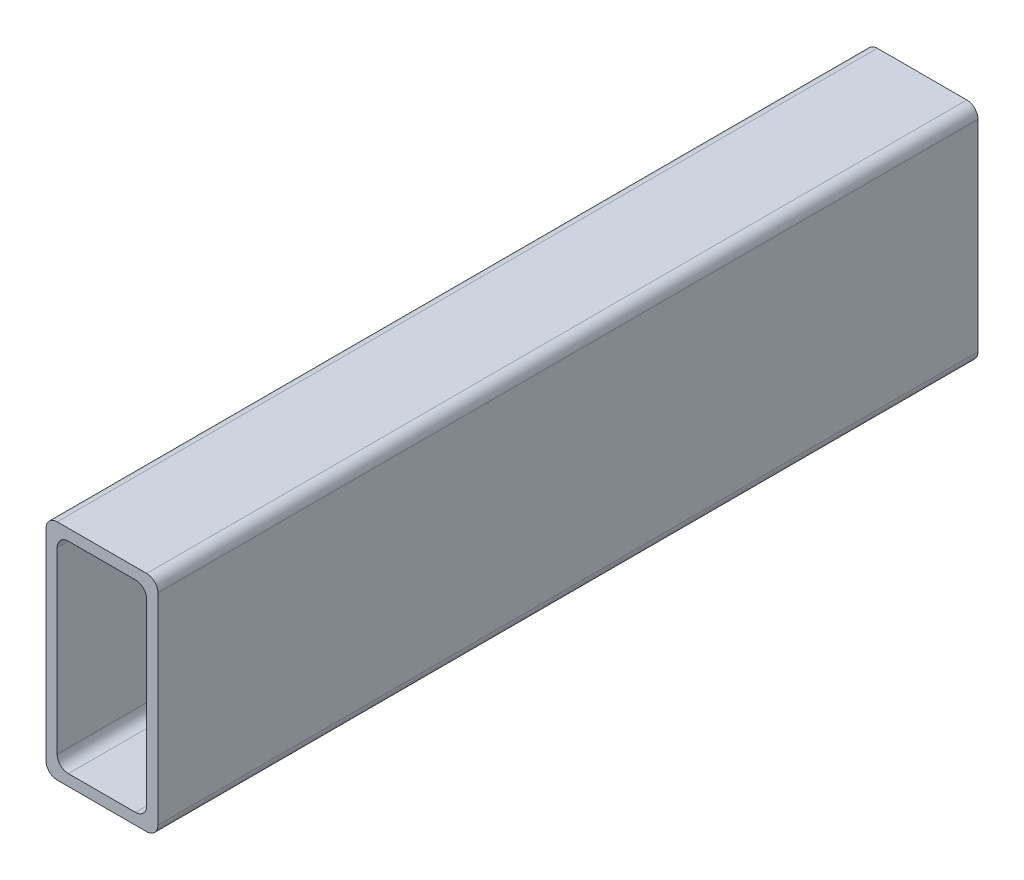
ISO-10303-21;
HEADER;
FILE_DESCRIPTION(('STEP AP214'),'2;1');
FILE_NAME('part.step','',(''),(''),'','','');
FILE_SCHEMA(('AUTOMOTIVE_DESIGN { 1 0 10303 214 1 1 1 1 }'));
ENDSEC;
DATA;
#1=APPLICATION_CONTEXT('core data for automotive mechanical design processes');
#2=APPLICATION_PROTOCOL_DEFINITION('international standard','automotive_design',2000,#1);
#3=PRODUCT_CONTEXT('',#1,'mechanical');
#4=PRODUCT('Part','Part','',(#3));
#5=PRODUCT_RELATED_PRODUCT_CATEGORY('part','',(#4));
#6=PRODUCT_DEFINITION_FORMATION('','',#4);
#7=PRODUCT_DEFINITION_CONTEXT('part definition',#1,'design');
#8=PRODUCT_DEFINITION('design','',#6,#7);
#9=PRODUCT_DEFINITION_SHAPE('','',#8);
#10=(LENGTH_UNIT() NAMED_UNIT(*) SI_UNIT(.MILLI.,.METRE.));
#11=(NAMED_UNIT(*) PLANE_ANGLE_UNIT() SI_UNIT($,.RADIAN.));
#12=(NAMED_UNIT(*) SI_UNIT($,.STERADIAN.) SOLID_ANGLE_UNIT());
#13=UNCERTAINTY_MEASURE_WITH_UNIT(LENGTH_MEASURE(1.E-05),#10,'distance_accuracy_value','');
#14=(GEOMETRIC_REPRESENTATION_CONTEXT(3) GLOBAL_UNCERTAINTY_ASSIGNED_CONTEXT((#13)) GLOBAL_UNIT_ASSIGNED_CONTEXT((#10,
#11,#12)) REPRESENTATION_CONTEXT('',''));
#15=CARTESIAN_POINT('',(0.,0.,0.));
#16=DIRECTION('',(0.,0.,1.));
#17=DIRECTION('',(1.,0.,0.));
#18=AXIS2_PLACEMENT_3D('',#15,#16,#17);
#19=CARTESIAN_POINT('',(-12.,27.,220.));
#20=DIRECTION('',(0.,0.,-1.));
#21=DIRECTION('',(-1.,0.,0.));
#22=AXIS2_PLACEMENT_3D('',#19,#20,#21);
#23=PLANE('',#22);
#24=CARTESIAN_POINT('',(-12.,27.,220.));
#25=DIRECTION('',(0.,0.,1.));
#26=DIRECTION('',(-1.,0.,0.));
#27=AXIS2_PLACEMENT_3D('',#24,#25,#26);
#28=CIRCLE('',#27,3.);
#29=CARTESIAN_POINT('',(-12.,30.,220.));
#30=VERTEX_POINT('',#29);
#31=CARTESIAN_POINT('',(-15.,27.,220.));
#32=VERTEX_POINT('',#31);
#33=EDGE_CURVE('E213',#30,#32,#28,.T.);
#34=ORIENTED_EDGE('',*,*,#33,.T.);
#35=DIRECTION('',(0.,-1.,0.));
#36=VECTOR('',#35,1.);
#37=CARTESIAN_POINT('',(-15.,-27.,220.));
#38=LINE('',#37,#36);
#39=CARTESIAN_POINT('',(-15.,-27.,220.));
#40=VERTEX_POINT('',#39);
#41=EDGE_CURVE('E216',#32,#40,#38,.T.);
#42=ORIENTED_EDGE('',*,*,#41,.T.);
#43=CARTESIAN_POINT('',(-12.,-27.,220.));
#44=DIRECTION('',(0.,0.,1.));
#45=DIRECTION('',(-1.,0.,0.));
#46=AXIS2_PLACEMENT_3D('',#43,#44,#45);
#47=CIRCLE('',#46,3.);
#48=CARTESIAN_POINT('',(-12.,-30.,220.));
#49=VERTEX_POINT('',#48);
#50=EDGE_CURVE('E219',#40,#49,#47,.T.);
#51=ORIENTED_EDGE('',*,*,#50,.T.);
#52=DIRECTION('',(1.,0.,0.));
#53=VECTOR('',#52,1.);
#54=CARTESIAN_POINT('',(-12.,-30.,220.));
#55=LINE('',#54,#53);
#56=CARTESIAN_POINT('',(12.,-30.,220.));
#57=VERTEX_POINT('',#56);
#58=EDGE_CURVE('E221',#49,#57,#55,.T.);
#59=ORIENTED_EDGE('',*,*,#58,.T.);
#60=CARTESIAN_POINT('',(12.,-27.,220.));
#61=DIRECTION('',(0.,0.,1.));
#62=DIRECTION('',(1.,0.,0.));
#63=AXIS2_PLACEMENT_3D('',#60,#61,#62);
#64=CIRCLE('',#63,3.);
#65=CARTESIAN_POINT('',(15.,-27.,220.));
#66=VERTEX_POINT('',#65);
#67=EDGE_CURVE('E223',#57,#66,#64,.T.);
#68=ORIENTED_EDGE('',*,*,#67,.T.);
#69=DIRECTION('',(0.,1.,0.));
#70=VECTOR('',#69,1.);
#71=CARTESIAN_POINT('',(15.,-27.,220.));
#72=LINE('',#71,#70);
#73=CARTESIAN_POINT('',(15.,27.,220.));
#74=VERTEX_POINT('',#73);
#75=EDGE_CURVE('E225',#66,#74,#72,.T.);
#76=ORIENTED_EDGE('',*,*,#75,.T.);
#77=CARTESIAN_POINT('',(12.,27.,220.));
#78=DIRECTION('',(0.,0.,1.));
#79=DIRECTION('',(-1.,0.,0.));
#80=AXIS2_PLACEMENT_3D('',#77,#78,#79);
#81=CIRCLE('',#80,3.);
#82=CARTESIAN_POINT('',(12.,30.,220.));
#83=VERTEX_POINT('',#82);
#84=EDGE_CURVE('E227',#74,#83,#81,.T.);
#85=ORIENTED_EDGE('',*,*,#84,.T.);
#86=DIRECTION('',(-1.,0.,0.));
#87=VECTOR('',#86,1.);
#88=CARTESIAN_POINT('',(-12.,30.,220.));
#89=LINE('',#88,#87);
#90=EDGE_CURVE('E229',#83,#30,#89,.T.);
#91=ORIENTED_EDGE('',*,*,#90,.T.);
#92=EDGE_LOOP('',(#34,#42,#51,#59,#68,#76,#85,#91));
#93=FACE_BOUND('',#92,.T.);
#94=CARTESIAN_POINT('',(-8.99999999999998,-24.,220.));
#95=DIRECTION('',(0.,0.,1.));
#96=DIRECTION('',(1.,0.,0.));
#97=AXIS2_PLACEMENT_3D('',#94,#95,#96);
#98=CIRCLE('',#97,3.);
#99=CARTESIAN_POINT('',(-12.,-24.,220.));
#100=VERTEX_POINT('',#99);
#101=CARTESIAN_POINT('',(-8.99999999999996,-27.,220.));
#102=VERTEX_POINT('',#101);
#103=EDGE_CURVE('E148',#100,#102,#98,.T.);
#104=ORIENTED_EDGE('',*,*,#103,.F.);
#105=DIRECTION('',(0.,-1.,0.));
#106=VECTOR('',#105,1.);
#107=CARTESIAN_POINT('',(-12.,-24.,220.));
#108=LINE('',#107,#106);
#109=CARTESIAN_POINT('',(-12.,24.,220.));
#110=VERTEX_POINT('',#109);
#111=EDGE_CURVE('E181',#110,#100,#108,.T.);
#112=ORIENTED_EDGE('',*,*,#111,.F.);
#113=CARTESIAN_POINT('',(-9.,24.,220.));
#114=DIRECTION('',(0.,0.,1.));
#115=DIRECTION('',(-1.,0.,0.));
#116=AXIS2_PLACEMENT_3D('',#113,#114,#115);
#117=CIRCLE('',#116,3.);
#118=CARTESIAN_POINT('',(-8.99999999999998,27.,220.));
#119=VERTEX_POINT('',#118);
#120=EDGE_CURVE('E179',#119,#110,#117,.T.);
#121=ORIENTED_EDGE('',*,*,#120,.F.);
#122=DIRECTION('',(-1.,0.,0.));
#123=VECTOR('',#122,1.);
#124=CARTESIAN_POINT('',(-8.99999999999998,27.,220.));
#125=LINE('',#124,#123);
#126=CARTESIAN_POINT('',(8.99999999999996,27.,220.));
#127=VERTEX_POINT('',#126);
#128=EDGE_CURVE('E177',#127,#119,#125,.T.);
#129=ORIENTED_EDGE('',*,*,#128,.F.);
#130=CARTESIAN_POINT('',(8.99999999999998,24.,220.));
#131=DIRECTION('',(0.,0.,1.));
#132=DIRECTION('',(-1.,0.,0.));
#133=AXIS2_PLACEMENT_3D('',#130,#131,#132);
#134=CIRCLE('',#133,3.);
#135=CARTESIAN_POINT('',(12.,24.,220.));
#136=VERTEX_POINT('',#135);
#137=EDGE_CURVE('E175',#136,#127,#134,.T.);
#138=ORIENTED_EDGE('',*,*,#137,.F.);
#139=DIRECTION('',(0.,1.,0.));
#140=VECTOR('',#139,1.);
#141=CARTESIAN_POINT('',(12.,-24.,220.));
#142=LINE('',#141,#140);
#143=CARTESIAN_POINT('',(12.,-24.,220.));
#144=VERTEX_POINT('',#143);
#145=EDGE_CURVE('E171',#144,#136,#142,.T.);
#146=ORIENTED_EDGE('',*,*,#145,.F.);
#147=CARTESIAN_POINT('',(9.,-24.,220.));
#148=DIRECTION('',(0.,0.,1.));
#149=DIRECTION('',(-1.,0.,0.));
#150=AXIS2_PLACEMENT_3D('',#147,#148,#149);
#151=CIRCLE('',#150,3.);
#152=CARTESIAN_POINT('',(8.99999999999998,-27.,220.));
#153=VERTEX_POINT('',#152);
#154=EDGE_CURVE('E169',#153,#144,#151,.T.);
#155=ORIENTED_EDGE('',*,*,#154,.F.);
#156=DIRECTION('',(1.,0.,0.));
#157=VECTOR('',#156,1.);
#158=CARTESIAN_POINT('',(-8.99999999999996,-27.,220.));
#159=LINE('',#158,#157);
#160=EDGE_CURVE('E156',#102,#153,#159,.T.);
#161=ORIENTED_EDGE('',*,*,#160,.F.);
#162=EDGE_LOOP('',(#104,#112,#121,#129,#138,#146,#155,#161));
#163=FACE_BOUND('',#162,.T.);
#164=ADVANCED_FACE('F35',(#93,#163),#23,.F.);
#165=CARTESIAN_POINT('',(-12.,27.,0.));
#166=DIRECTION('',(0.,0.,-1.));
#167=DIRECTION('',(-1.,0.,0.));
#168=AXIS2_PLACEMENT_3D('',#165,#166,#167);
#169=PLANE('',#168);
#170=CARTESIAN_POINT('',(-12.,27.,0.));
#171=DIRECTION('',(0.,0.,1.));
#172=DIRECTION('',(-1.,0.,0.));
#173=AXIS2_PLACEMENT_3D('',#170,#171,#172);
#174=CIRCLE('',#173,3.);
#175=CARTESIAN_POINT('',(-12.,30.,0.));
#176=VERTEX_POINT('',#175);
#177=CARTESIAN_POINT('',(-15.,27.,0.));
#178=VERTEX_POINT('',#177);
#179=EDGE_CURVE('E164',#176,#178,#174,.T.);
#180=ORIENTED_EDGE('',*,*,#179,.F.);
#181=DIRECTION('',(-1.,0.,0.));
#182=VECTOR('',#181,1.);
#183=CARTESIAN_POINT('',(-12.,30.,0.));
#184=LINE('',#183,#182);
#185=CARTESIAN_POINT('',(12.,30.,0.));
#186=VERTEX_POINT('',#185);
#187=EDGE_CURVE('E217',#186,#176,#184,.T.);
#188=ORIENTED_EDGE('',*,*,#187,.F.);
#189=CARTESIAN_POINT('',(12.,27.,0.));
#190=DIRECTION('',(0.,0.,1.));
#191=DIRECTION('',(-1.,0.,0.));
#192=AXIS2_PLACEMENT_3D('',#189,#190,#191);
#193=CIRCLE('',#192,3.);
#194=CARTESIAN_POINT('',(15.,27.,0.));
#195=VERTEX_POINT('',#194);
#196=EDGE_CURVE('E244',#195,#186,#193,.T.);
#197=ORIENTED_EDGE('',*,*,#196,.F.);
#198=DIRECTION('',(0.,1.,0.));
#199=VECTOR('',#198,1.);
#200=CARTESIAN_POINT('',(15.,-27.,0.));
#201=LINE('',#200,#199);
#202=CARTESIAN_POINT('',(15.,-27.,0.));
#203=VERTEX_POINT('',#202);
#204=EDGE_CURVE('E242',#203,#195,#201,.T.);
#205=ORIENTED_EDGE('',*,*,#204,.F.);
#206=CARTESIAN_POINT('',(12.,-27.,0.));
#207=DIRECTION('',(0.,0.,1.));
#208=DIRECTION('',(1.,0.,0.));
#209=AXIS2_PLACEMENT_3D('',#206,#207,#208);
#210=CIRCLE('',#209,3.);
#211=CARTESIAN_POINT('',(12.,-30.,0.));
#212=VERTEX_POINT('',#211);
#213=EDGE_CURVE('E240',#212,#203,#210,.T.);
#214=ORIENTED_EDGE('',*,*,#213,.F.);
#215=DIRECTION('',(1.,0.,0.));
#216=VECTOR('',#215,1.);
#217=CARTESIAN_POINT('',(-12.,-30.,0.));
#218=LINE('',#217,#216);
#219=CARTESIAN_POINT('',(-12.,-30.,0.));
#220=VERTEX_POINT('',#219);
#221=EDGE_CURVE('E238',#220,#212,#218,.T.);
#222=ORIENTED_EDGE('',*,*,#221,.F.);
#223=CARTESIAN_POINT('',(-12.,-27.,0.));
#224=DIRECTION('',(0.,0.,1.));
#225=DIRECTION('',(-1.,0.,0.));
#226=AXIS2_PLACEMENT_3D('',#223,#224,#225);
#227=CIRCLE('',#226,3.);
#228=CARTESIAN_POINT('',(-15.,-27.,0.));
#229=VERTEX_POINT('',#228);
#230=EDGE_CURVE('E236',#229,#220,#227,.T.);
#231=ORIENTED_EDGE('',*,*,#230,.F.);
#232=DIRECTION('',(0.,-1.,0.));
#233=VECTOR('',#232,1.);
#234=CARTESIAN_POINT('',(-15.,-27.,0.));
#235=LINE('',#234,#233);
#236=EDGE_CURVE('E234',#178,#229,#235,.T.);
#237=ORIENTED_EDGE('',*,*,#236,.F.);
#238=EDGE_LOOP('',(#180,#188,#197,#205,#214,#222,#231,#237));
#239=FACE_BOUND('',#238,.T.);
#240=DIRECTION('',(0.,-1.,0.));
#241=VECTOR('',#240,1.);
#242=CARTESIAN_POINT('',(-12.,-24.,0.));
#243=LINE('',#242,#241);
#244=CARTESIAN_POINT('',(-12.,24.,0.));
#245=VERTEX_POINT('',#244);
#246=CARTESIAN_POINT('',(-12.,-24.,0.));
#247=VERTEX_POINT('',#246);
#248=EDGE_CURVE('E157',#245,#247,#243,.T.);
#249=ORIENTED_EDGE('',*,*,#248,.T.);
#250=CARTESIAN_POINT('',(-8.99999999999998,-24.,0.));
#251=DIRECTION('',(0.,0.,1.));
#252=DIRECTION('',(1.,0.,0.));
#253=AXIS2_PLACEMENT_3D('',#250,#251,#252);
#254=CIRCLE('',#253,3.);
#255=CARTESIAN_POINT('',(-8.99999999999996,-27.,0.));
#256=VERTEX_POINT('',#255);
#257=EDGE_CURVE('E58',#247,#256,#254,.T.);
#258=ORIENTED_EDGE('',*,*,#257,.T.);
#259=DIRECTION('',(1.,0.,0.));
#260=VECTOR('',#259,1.);
#261=CARTESIAN_POINT('',(-8.99999999999996,-27.,0.));
#262=LINE('',#261,#260);
#263=CARTESIAN_POINT('',(8.99999999999998,-27.,0.));
#264=VERTEX_POINT('',#263);
#265=EDGE_CURVE('E163',#256,#264,#262,.T.);
#266=ORIENTED_EDGE('',*,*,#265,.T.);
#267=CARTESIAN_POINT('',(9.,-24.,0.));
#268=DIRECTION('',(0.,0.,1.));
#269=DIRECTION('',(-1.,0.,0.));
#270=AXIS2_PLACEMENT_3D('',#267,#268,#269);
#271=CIRCLE('',#270,3.);
#272=CARTESIAN_POINT('',(12.,-24.,0.));
#273=VERTEX_POINT('',#272);
#274=EDGE_CURVE('E185',#264,#273,#271,.T.);
#275=ORIENTED_EDGE('',*,*,#274,.T.);
#276=DIRECTION('',(0.,1.,0.));
#277=VECTOR('',#276,1.);
#278=CARTESIAN_POINT('',(12.,-24.,0.));
#279=LINE('',#278,#277);
#280=CARTESIAN_POINT('',(12.,24.,0.));
#281=VERTEX_POINT('',#280);
#282=EDGE_CURVE('E188',#273,#281,#279,.T.);
#283=ORIENTED_EDGE('',*,*,#282,.T.);
#284=CARTESIAN_POINT('',(8.99999999999998,24.,0.));
#285=DIRECTION('',(0.,0.,1.));
#286=DIRECTION('',(-1.,0.,0.));
#287=AXIS2_PLACEMENT_3D('',#284,#285,#286);
#288=CIRCLE('',#287,3.);
#289=CARTESIAN_POINT('',(8.99999999999996,27.,0.));
#290=VERTEX_POINT('',#289);
#291=EDGE_CURVE('E191',#281,#290,#288,.T.);
#292=ORIENTED_EDGE('',*,*,#291,.T.);
#293=DIRECTION('',(-1.,0.,0.));
#294=VECTOR('',#293,1.);
#295=CARTESIAN_POINT('',(-8.99999999999998,27.,0.));
#296=LINE('',#295,#294);
#297=CARTESIAN_POINT('',(-8.99999999999998,27.,0.));
#298=VERTEX_POINT('',#297);
#299=EDGE_CURVE('E194',#290,#298,#296,.T.);
#300=ORIENTED_EDGE('',*,*,#299,.T.);
#301=CARTESIAN_POINT('',(-9.,24.,0.));
#302=DIRECTION('',(0.,0.,1.));
#303=DIRECTION('',(-1.,0.,0.));
#304=AXIS2_PLACEMENT_3D('',#301,#302,#303);
#305=CIRCLE('',#304,3.);
#306=EDGE_CURVE('E197',#298,#245,#305,.T.);
#307=ORIENTED_EDGE('',*,*,#306,.T.);
#308=EDGE_LOOP('',(#249,#258,#266,#275,#283,#292,#300,#307));
#309=FACE_BOUND('',#308,.T.);
#310=ADVANCED_FACE('F274',(#239,#309),#169,.T.);
#311=CARTESIAN_POINT('',(-12.,27.,220.));
#312=DIRECTION('',(0.,0.,-1.));
#313=DIRECTION('',(-1.,0.,0.));
#314=AXIS2_PLACEMENT_3D('',#311,#312,#313);
#315=CYLINDRICAL_SURFACE('',#314,3.);
#316=ORIENTED_EDGE('',*,*,#179,.T.);
#317=DIRECTION('',(0.,0.,-1.));
#318=VECTOR('',#317,1.);
#319=CARTESIAN_POINT('',(-15.,27.,220.));
#320=LINE('',#319,#318);
#321=EDGE_CURVE('E11',#32,#178,#320,.T.);
#322=ORIENTED_EDGE('',*,*,#321,.F.);
#323=ORIENTED_EDGE('',*,*,#33,.F.);
#324=DIRECTION('',(0.,0.,-1.));
#325=VECTOR('',#324,1.);
#326=CARTESIAN_POINT('',(-12.,30.,220.));
#327=LINE('',#326,#325);
#328=EDGE_CURVE('E231',#30,#176,#327,.T.);
#329=ORIENTED_EDGE('',*,*,#328,.T.);
#330=EDGE_LOOP('',(#316,#322,#323,#329));
#331=FACE_BOUND('',#330,.T.);
#332=ADVANCED_FACE('F37',(#331),#315,.T.);
#333=CARTESIAN_POINT('',(-15.,-27.,220.));
#334=DIRECTION('',(1.,0.,0.));
#335=DIRECTION('',(0.,0.,-1.));
#336=AXIS2_PLACEMENT_3D('',#333,#334,#335);
#337=PLANE('',#336);
#338=ORIENTED_EDGE('',*,*,#236,.T.);
#339=DIRECTION('',(0.,0.,-1.));
#340=VECTOR('',#339,1.);
#341=CARTESIAN_POINT('',(-15.,-27.,220.));
#342=LINE('',#341,#340);
#343=EDGE_CURVE('E43',#40,#229,#342,.T.);
#344=ORIENTED_EDGE('',*,*,#343,.F.);
#345=ORIENTED_EDGE('',*,*,#41,.F.);
#346=ORIENTED_EDGE('',*,*,#321,.T.);
#347=EDGE_LOOP('',(#338,#344,#345,#346));
#348=FACE_BOUND('',#347,.T.);
#349=ADVANCED_FACE('F291',(#348),#337,.F.);
#350=CARTESIAN_POINT('',(-12.,-27.,220.));
#351=DIRECTION('',(0.,0.,-1.));
#352=DIRECTION('',(-1.,0.,0.));
#353=AXIS2_PLACEMENT_3D('',#350,#351,#352);
#354=CYLINDRICAL_SURFACE('',#353,3.);
#355=ORIENTED_EDGE('',*,*,#230,.T.);
#356=DIRECTION('',(0.,0.,-1.));
#357=VECTOR('',#356,1.);
#358=CARTESIAN_POINT('',(-12.,-30.,220.));
#359=LINE('',#358,#357);
#360=EDGE_CURVE('E261',#49,#220,#359,.T.);
#361=ORIENTED_EDGE('',*,*,#360,.F.);
#362=ORIENTED_EDGE('',*,*,#50,.F.);
#363=ORIENTED_EDGE('',*,*,#343,.T.);
#364=EDGE_LOOP('',(#355,#361,#362,#363));
#365=FACE_BOUND('',#364,.T.);
#366=ADVANCED_FACE('F268',(#365),#354,.T.);
#367=CARTESIAN_POINT('',(-12.,-30.,220.));
#368=DIRECTION('',(0.,1.,0.));
#369=DIRECTION('',(0.,0.,1.));
#370=AXIS2_PLACEMENT_3D('',#367,#368,#369);
#371=PLANE('',#370);
#372=ORIENTED_EDGE('',*,*,#221,.T.);
#373=DIRECTION('',(0.,0.,-1.));
#374=VECTOR('',#373,1.);
#375=CARTESIAN_POINT('',(12.,-30.,220.));
#376=LINE('',#375,#374);
#377=EDGE_CURVE('E258',#57,#212,#376,.T.);
#378=ORIENTED_EDGE('',*,*,#377,.F.);
#379=ORIENTED_EDGE('',*,*,#58,.F.);
#380=ORIENTED_EDGE('',*,*,#360,.T.);
#381=EDGE_LOOP('',(#372,#378,#379,#380));
#382=FACE_BOUND('',#381,.T.);
#383=ADVANCED_FACE('F280',(#382),#371,.F.);
#384=CARTESIAN_POINT('',(12.,-27.,220.));
#385=DIRECTION('',(0.,0.,-1.));
#386=DIRECTION('',(-1.,0.,0.));
#387=AXIS2_PLACEMENT_3D('',#384,#385,#386);
#388=CYLINDRICAL_SURFACE('',#387,3.);
#389=ORIENTED_EDGE('',*,*,#213,.T.);
#390=DIRECTION('',(0.,0.,-1.));
#391=VECTOR('',#390,1.);
#392=CARTESIAN_POINT('',(15.,-27.,220.));
#393=LINE('',#392,#391);
#394=EDGE_CURVE('E255',#66,#203,#393,.T.);
#395=ORIENTED_EDGE('',*,*,#394,.F.);
#396=ORIENTED_EDGE('',*,*,#67,.F.);
#397=ORIENTED_EDGE('',*,*,#377,.T.);
#398=EDGE_LOOP('',(#389,#395,#396,#397));
#399=FACE_BOUND('',#398,.T.);
#400=ADVANCED_FACE('F284',(#399),#388,.T.);
#401=CARTESIAN_POINT('',(15.,-27.,220.));
#402=DIRECTION('',(-1.,0.,0.));
#403=DIRECTION('',(0.,0.,1.));
#404=AXIS2_PLACEMENT_3D('',#401,#402,#403);
#405=PLANE('',#404);
#406=ORIENTED_EDGE('',*,*,#204,.T.);
#407=DIRECTION('',(0.,0.,-1.));
#408=VECTOR('',#407,1.);
#409=CARTESIAN_POINT('',(15.,27.,220.));
#410=LINE('',#409,#408);
#411=EDGE_CURVE('E252',#74,#195,#410,.T.);
#412=ORIENTED_EDGE('',*,*,#411,.F.);
#413=ORIENTED_EDGE('',*,*,#75,.F.);
#414=ORIENTED_EDGE('',*,*,#394,.T.);
#415=EDGE_LOOP('',(#406,#412,#413,#414));
#416=FACE_BOUND('',#415,.T.);
#417=ADVANCED_FACE('F304',(#416),#405,.F.);
#418=CARTESIAN_POINT('',(12.,27.,220.));
#419=DIRECTION('',(0.,0.,-1.));
#420=DIRECTION('',(-1.,0.,0.));
#421=AXIS2_PLACEMENT_3D('',#418,#419,#420);
#422=CYLINDRICAL_SURFACE('',#421,3.);
#423=ORIENTED_EDGE('',*,*,#196,.T.);
#424=DIRECTION('',(0.,0.,-1.));
#425=VECTOR('',#424,1.);
#426=CARTESIAN_POINT('',(12.,30.,220.));
#427=LINE('',#426,#425);
#428=EDGE_CURVE('E249',#83,#186,#427,.T.);
#429=ORIENTED_EDGE('',*,*,#428,.F.);
#430=ORIENTED_EDGE('',*,*,#84,.F.);
#431=ORIENTED_EDGE('',*,*,#411,.T.);
#432=EDGE_LOOP('',(#423,#429,#430,#431));
#433=FACE_BOUND('',#432,.T.);
#434=ADVANCED_FACE('F302',(#433),#422,.T.);
#435=CARTESIAN_POINT('',(-12.,30.,220.));
#436=DIRECTION('',(0.,-1.,0.));
#437=DIRECTION('',(0.,0.,-1.));
#438=AXIS2_PLACEMENT_3D('',#435,#436,#437);
#439=PLANE('',#438);
#440=ORIENTED_EDGE('',*,*,#187,.T.);
#441=ORIENTED_EDGE('',*,*,#328,.F.);
#442=ORIENTED_EDGE('',*,*,#90,.F.);
#443=ORIENTED_EDGE('',*,*,#428,.T.);
#444=EDGE_LOOP('',(#440,#441,#442,#443));
#445=FACE_BOUND('',#444,.T.);
#446=ADVANCED_FACE('F297',(#445),#439,.F.);
#447=CARTESIAN_POINT('',(-8.99999999999998,-24.,220.));
#448=DIRECTION('',(0.,0.,-1.));
#449=DIRECTION('',(-1.,0.,0.));
#450=AXIS2_PLACEMENT_3D('',#447,#448,#449);
#451=CYLINDRICAL_SURFACE('',#450,3.);
#452=ORIENTED_EDGE('',*,*,#257,.F.);
#453=DIRECTION('',(0.,0.,-1.));
#454=VECTOR('',#453,1.);
#455=CARTESIAN_POINT('',(-12.,-24.,220.));
#456=LINE('',#455,#454);
#457=EDGE_CURVE('E152',#100,#247,#456,.T.);
#458=ORIENTED_EDGE('',*,*,#457,.F.);
#459=ORIENTED_EDGE('',*,*,#103,.T.);
#460=DIRECTION('',(0.,0.,-1.));
#461=VECTOR('',#460,1.);
#462=CARTESIAN_POINT('',(-8.99999999999996,-27.,220.));
#463=LINE('',#462,#461);
#464=EDGE_CURVE('E151',#102,#256,#463,.T.);
#465=ORIENTED_EDGE('',*,*,#464,.T.);
#466=EDGE_LOOP('',(#452,#458,#459,#465));
#467=FACE_BOUND('',#466,.T.);
#468=ADVANCED_FACE('F150',(#467),#451,.F.);
#469=CARTESIAN_POINT('',(-8.99999999999996,-27.,220.));
#470=DIRECTION('',(0.,1.,0.));
#471=DIRECTION('',(-1.,0.,0.));
#472=AXIS2_PLACEMENT_3D('',#469,#470,#471);
#473=PLANE('',#472);
#474=ORIENTED_EDGE('',*,*,#265,.F.);
#475=ORIENTED_EDGE('',*,*,#464,.F.);
#476=ORIENTED_EDGE('',*,*,#160,.T.);
#477=DIRECTION('',(0.,0.,-1.));
#478=VECTOR('',#477,1.);
#479=CARTESIAN_POINT('',(8.99999999999998,-27.,220.));
#480=LINE('',#479,#478);
#481=EDGE_CURVE('E165',#153,#264,#480,.T.);
#482=ORIENTED_EDGE('',*,*,#481,.T.);
#483=EDGE_LOOP('',(#474,#475,#476,#482));
#484=FACE_BOUND('',#483,.T.);
#485=ADVANCED_FACE('F160',(#484),#473,.T.);
#486=CARTESIAN_POINT('',(9.,-24.,220.));
#487=DIRECTION('',(0.,0.,-1.));
#488=DIRECTION('',(-1.,0.,0.));
#489=AXIS2_PLACEMENT_3D('',#486,#487,#488);
#490=CYLINDRICAL_SURFACE('',#489,3.);
#491=ORIENTED_EDGE('',*,*,#274,.F.);
#492=ORIENTED_EDGE('',*,*,#481,.F.);
#493=ORIENTED_EDGE('',*,*,#154,.T.);
#494=DIRECTION('',(0.,0.,-1.));
#495=VECTOR('',#494,1.);
#496=CARTESIAN_POINT('',(12.,-24.,220.));
#497=LINE('',#496,#495);
#498=EDGE_CURVE('E210',#144,#273,#497,.T.);
#499=ORIENTED_EDGE('',*,*,#498,.T.);
#500=EDGE_LOOP('',(#491,#492,#493,#499));
#501=FACE_BOUND('',#500,.T.);
#502=ADVANCED_FACE('F329',(#501),#490,.F.);
#503=CARTESIAN_POINT('',(12.,-24.,220.));
#504=DIRECTION('',(-1.,0.,0.));
#505=DIRECTION('',(0.,-1.,0.));
#506=AXIS2_PLACEMENT_3D('',#503,#504,#505);
#507=PLANE('',#506);
#508=ORIENTED_EDGE('',*,*,#282,.F.);
#509=ORIENTED_EDGE('',*,*,#498,.F.);
#510=ORIENTED_EDGE('',*,*,#145,.T.);
#511=DIRECTION('',(0.,0.,-1.));
#512=VECTOR('',#511,1.);
#513=CARTESIAN_POINT('',(12.,24.,220.));
#514=LINE('',#513,#512);
#515=EDGE_CURVE('E208',#136,#281,#514,.T.);
#516=ORIENTED_EDGE('',*,*,#515,.T.);
#517=EDGE_LOOP('',(#508,#509,#510,#516));
#518=FACE_BOUND('',#517,.T.);
#519=ADVANCED_FACE('F333',(#518),#507,.T.);
#520=CARTESIAN_POINT('',(8.99999999999998,24.,220.));
#521=DIRECTION('',(0.,0.,-1.));
#522=DIRECTION('',(-1.,0.,0.));
#523=AXIS2_PLACEMENT_3D('',#520,#521,#522);
#524=CYLINDRICAL_SURFACE('',#523,3.);
#525=ORIENTED_EDGE('',*,*,#291,.F.);
#526=ORIENTED_EDGE('',*,*,#515,.F.);
#527=ORIENTED_EDGE('',*,*,#137,.T.);
#528=DIRECTION('',(0.,0.,-1.));
#529=VECTOR('',#528,1.);
#530=CARTESIAN_POINT('',(8.99999999999996,27.,220.));
#531=LINE('',#530,#529);
#532=EDGE_CURVE('E206',#127,#290,#531,.T.);
#533=ORIENTED_EDGE('',*,*,#532,.T.);
#534=EDGE_LOOP('',(#525,#526,#527,#533));
#535=FACE_BOUND('',#534,.T.);
#536=ADVANCED_FACE('F339',(#535),#524,.F.);
#537=CARTESIAN_POINT('',(-8.99999999999998,27.,220.));
#538=DIRECTION('',(0.,-1.,0.));
#539=DIRECTION('',(0.,0.,-1.));
#540=AXIS2_PLACEMENT_3D('',#537,#538,#539);
#541=PLANE('',#540);
#542=ORIENTED_EDGE('',*,*,#299,.F.);
#543=ORIENTED_EDGE('',*,*,#532,.F.);
#544=ORIENTED_EDGE('',*,*,#128,.T.);
#545=DIRECTION('',(0.,0.,-1.));
#546=VECTOR('',#545,1.);
#547=CARTESIAN_POINT('',(-8.99999999999998,27.,220.));
#548=LINE('',#547,#546);
#549=EDGE_CURVE('E204',#119,#298,#548,.T.);
#550=ORIENTED_EDGE('',*,*,#549,.T.);
#551=EDGE_LOOP('',(#542,#543,#544,#550));
#552=FACE_BOUND('',#551,.T.);
#553=ADVANCED_FACE('F343',(#552),#541,.T.);
#554=CARTESIAN_POINT('',(-9.,24.,220.));
#555=DIRECTION('',(0.,0.,-1.));
#556=DIRECTION('',(-1.,0.,0.));
#557=AXIS2_PLACEMENT_3D('',#554,#555,#556);
#558=CYLINDRICAL_SURFACE('',#557,3.);
#559=ORIENTED_EDGE('',*,*,#306,.F.);
#560=ORIENTED_EDGE('',*,*,#549,.F.);
#561=ORIENTED_EDGE('',*,*,#120,.T.);
#562=DIRECTION('',(0.,0.,-1.));
#563=VECTOR('',#562,1.);
#564=CARTESIAN_POINT('',(-12.,24.,220.));
#565=LINE('',#564,#563);
#566=EDGE_CURVE('E50',#110,#245,#565,.T.);
#567=ORIENTED_EDGE('',*,*,#566,.T.);
#568=EDGE_LOOP('',(#559,#560,#561,#567));
#569=FACE_BOUND('',#568,.T.);
#570=ADVANCED_FACE('F347',(#569),#558,.F.);
#571=CARTESIAN_POINT('',(-12.,-24.,220.));
#572=DIRECTION('',(1.,0.,0.));
#573=DIRECTION('',(0.,1.,0.));
#574=AXIS2_PLACEMENT_3D('',#571,#572,#573);
#575=PLANE('',#574);
#576=ORIENTED_EDGE('',*,*,#248,.F.);
#577=ORIENTED_EDGE('',*,*,#566,.F.);
#578=ORIENTED_EDGE('',*,*,#111,.T.);
#579=ORIENTED_EDGE('',*,*,#457,.T.);
#580=EDGE_LOOP('',(#576,#577,#578,#579));
#581=FACE_BOUND('',#580,.T.);
#582=ADVANCED_FACE('F351',(#581),#575,.T.);
#583=CLOSED_SHELL('',(#164,#310,#332,#349,#366,#383,#400,#417,#434,#446,#468,#485,#502,#519,
#536,#553,#570,#582));
#584=MANIFOLD_SOLID_BREP('B2',#583);
#585=ADVANCED_BREP_SHAPE_REPRESENTATION('',(#18,#584),#14);
#586=SHAPE_DEFINITION_REPRESENTATION(#9,#585);
ENDSEC;
END-ISO-10303-21;
